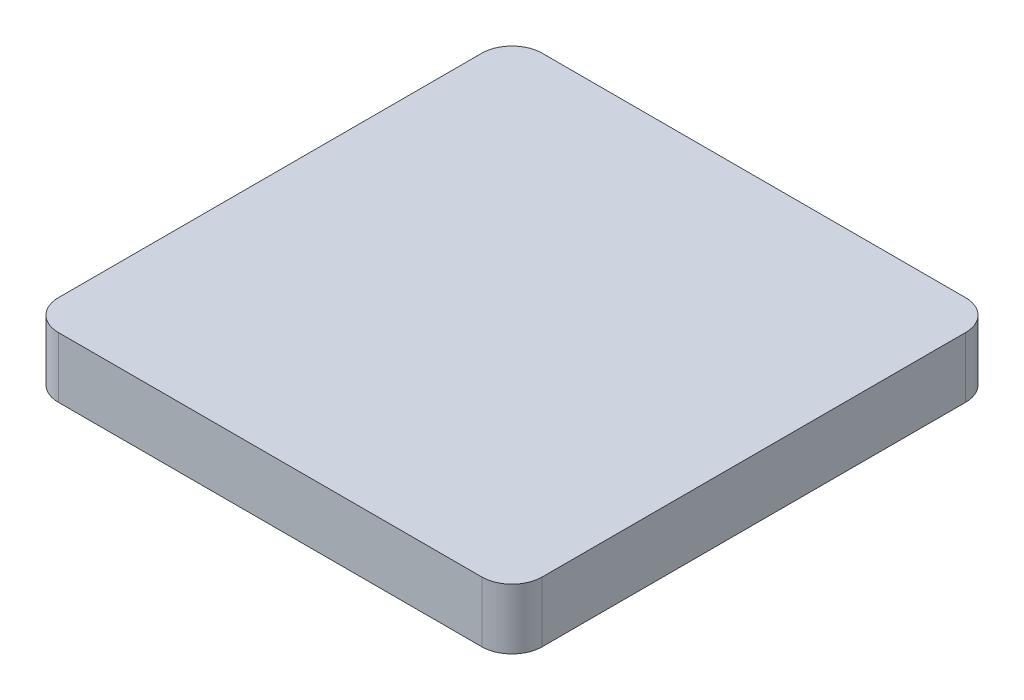
ISO-10303-21;
HEADER;
FILE_DESCRIPTION(('STEP AP214'),'2;1');
FILE_NAME('part.step','',(''),(''),'','','');
FILE_SCHEMA(('AUTOMOTIVE_DESIGN { 1 0 10303 214 1 1 1 1 }'));
ENDSEC;
DATA;
#1=APPLICATION_CONTEXT('core data for automotive mechanical design processes');
#2=APPLICATION_PROTOCOL_DEFINITION('international standard','automotive_design',2000,#1);
#3=PRODUCT_CONTEXT('',#1,'mechanical');
#4=PRODUCT('Part','Part','',(#3));
#5=PRODUCT_RELATED_PRODUCT_CATEGORY('part','',(#4));
#6=PRODUCT_DEFINITION_FORMATION('','',#4);
#7=PRODUCT_DEFINITION_CONTEXT('part definition',#1,'design');
#8=PRODUCT_DEFINITION('design','',#6,#7);
#9=PRODUCT_DEFINITION_SHAPE('','',#8);
#10=(LENGTH_UNIT() NAMED_UNIT(*) SI_UNIT(.MILLI.,.METRE.));
#11=(NAMED_UNIT(*) PLANE_ANGLE_UNIT() SI_UNIT($,.RADIAN.));
#12=(NAMED_UNIT(*) SI_UNIT($,.STERADIAN.) SOLID_ANGLE_UNIT());
#13=UNCERTAINTY_MEASURE_WITH_UNIT(LENGTH_MEASURE(1.E-05),#10,'distance_accuracy_value','');
#14=(GEOMETRIC_REPRESENTATION_CONTEXT(3) GLOBAL_UNCERTAINTY_ASSIGNED_CONTEXT((#13)) GLOBAL_UNIT_ASSIGNED_CONTEXT((#10,
#11,#12)) REPRESENTATION_CONTEXT('',''));
#15=CARTESIAN_POINT('',(0.,0.,0.));
#16=DIRECTION('',(0.,0.,1.));
#17=DIRECTION('',(1.,0.,0.));
#18=AXIS2_PLACEMENT_3D('',#15,#16,#17);
#19=CARTESIAN_POINT('',(0.,10.,0.));
#20=DIRECTION('',(1.,0.,0.));
#21=DIRECTION('',(0.,0.,-1.));
#22=AXIS2_PLACEMENT_3D('',#19,#20,#21);
#23=PLANE('',#22);
#24=DIRECTION('',(0.,0.,1.));
#25=VECTOR('',#24,1.);
#26=CARTESIAN_POINT('',(0.,10.,0.));
#27=LINE('',#26,#25);
#28=CARTESIAN_POINT('',(0.,10.,-75.));
#29=VERTEX_POINT('',#28);
#30=CARTESIAN_POINT('',(0.,10.,-5.));
#31=VERTEX_POINT('',#30);
#32=EDGE_CURVE('E203',#29,#31,#27,.T.);
#33=ORIENTED_EDGE('',*,*,#32,.F.);
#34=DIRECTION('',(0.,-1.,0.));
#35=VECTOR('',#34,1.);
#36=CARTESIAN_POINT('',(0.,10.,-75.));
#37=LINE('',#36,#35);
#38=CARTESIAN_POINT('',(0.,0.,-75.));
#39=VERTEX_POINT('',#38);
#40=EDGE_CURVE('E269',#29,#39,#37,.T.);
#41=ORIENTED_EDGE('',*,*,#40,.T.);
#42=DIRECTION('',(0.,0.,1.));
#43=VECTOR('',#42,1.);
#44=CARTESIAN_POINT('',(0.,0.,0.));
#45=LINE('',#44,#43);
#46=CARTESIAN_POINT('',(0.,0.,-5.));
#47=VERTEX_POINT('',#46);
#48=EDGE_CURVE('E199',#39,#47,#45,.T.);
#49=ORIENTED_EDGE('',*,*,#48,.T.);
#50=DIRECTION('',(0.,-1.,0.));
#51=VECTOR('',#50,1.);
#52=CARTESIAN_POINT('',(0.,10.,-5.));
#53=LINE('',#52,#51);
#54=EDGE_CURVE('E267',#47,#31,#53,.F.);
#55=ORIENTED_EDGE('',*,*,#54,.T.);
#56=EDGE_LOOP('',(#33,#41,#49,#55));
#57=FACE_BOUND('',#56,.T.);
#58=ADVANCED_FACE('F31',(#57),#23,.F.);
#59=CARTESIAN_POINT('',(0.,10.,0.));
#60=DIRECTION('',(0.,0.,-1.));
#61=DIRECTION('',(-1.,0.,0.));
#62=AXIS2_PLACEMENT_3D('',#59,#60,#61);
#63=PLANE('',#62);
#64=DIRECTION('',(1.,0.,0.));
#65=VECTOR('',#64,1.);
#66=CARTESIAN_POINT('',(0.,10.,0.));
#67=LINE('',#66,#65);
#68=CARTESIAN_POINT('',(5.,10.,0.));
#69=VERTEX_POINT('',#68);
#70=CARTESIAN_POINT('',(75.,10.,0.));
#71=VERTEX_POINT('',#70);
#72=EDGE_CURVE('E206',#69,#71,#67,.T.);
#73=ORIENTED_EDGE('',*,*,#72,.F.);
#74=DIRECTION('',(0.,-1.,0.));
#75=VECTOR('',#74,1.);
#76=CARTESIAN_POINT('',(5.,10.,0.));
#77=LINE('',#76,#75);
#78=CARTESIAN_POINT('',(5.,0.,0.));
#79=VERTEX_POINT('',#78);
#80=EDGE_CURVE('E11',#69,#79,#77,.T.);
#81=ORIENTED_EDGE('',*,*,#80,.T.);
#82=DIRECTION('',(1.,0.,0.));
#83=VECTOR('',#82,1.);
#84=CARTESIAN_POINT('',(0.,0.,0.));
#85=LINE('',#84,#83);
#86=CARTESIAN_POINT('',(75.,0.,0.));
#87=VERTEX_POINT('',#86);
#88=EDGE_CURVE('E218',#79,#87,#85,.T.);
#89=ORIENTED_EDGE('',*,*,#88,.T.);
#90=DIRECTION('',(0.,-1.,0.));
#91=VECTOR('',#90,1.);
#92=CARTESIAN_POINT('',(75.,10.,0.));
#93=LINE('',#92,#91);
#94=EDGE_CURVE('E39',#87,#71,#93,.F.);
#95=ORIENTED_EDGE('',*,*,#94,.T.);
#96=EDGE_LOOP('',(#73,#81,#89,#95));
#97=FACE_BOUND('',#96,.T.);
#98=ADVANCED_FACE('F286',(#97),#63,.F.);
#99=CARTESIAN_POINT('',(80.,10.,0.));
#100=DIRECTION('',(-1.,0.,0.));
#101=DIRECTION('',(0.,0.,1.));
#102=AXIS2_PLACEMENT_3D('',#99,#100,#101);
#103=PLANE('',#102);
#104=DIRECTION('',(0.,0.,-1.));
#105=VECTOR('',#104,1.);
#106=CARTESIAN_POINT('',(80.,0.,0.));
#107=LINE('',#106,#105);
#108=CARTESIAN_POINT('',(80.,0.,-5.));
#109=VERTEX_POINT('',#108);
#110=CARTESIAN_POINT('',(80.,0.,-75.));
#111=VERTEX_POINT('',#110);
#112=EDGE_CURVE('E220',#109,#111,#107,.T.);
#113=ORIENTED_EDGE('',*,*,#112,.T.);
#114=DIRECTION('',(0.,-1.,0.));
#115=VECTOR('',#114,1.);
#116=CARTESIAN_POINT('',(80.,10.,-75.));
#117=LINE('',#116,#115);
#118=CARTESIAN_POINT('',(80.,10.,-75.));
#119=VERTEX_POINT('',#118);
#120=EDGE_CURVE('E257',#111,#119,#117,.F.);
#121=ORIENTED_EDGE('',*,*,#120,.T.);
#122=DIRECTION('',(0.,0.,-1.));
#123=VECTOR('',#122,1.);
#124=CARTESIAN_POINT('',(80.,10.,0.));
#125=LINE('',#124,#123);
#126=CARTESIAN_POINT('',(80.,10.,-5.));
#127=VERTEX_POINT('',#126);
#128=EDGE_CURVE('E209',#127,#119,#125,.T.);
#129=ORIENTED_EDGE('',*,*,#128,.F.);
#130=DIRECTION('',(0.,-1.,0.));
#131=VECTOR('',#130,1.);
#132=CARTESIAN_POINT('',(80.,10.,-5.));
#133=LINE('',#132,#131);
#134=EDGE_CURVE('E254',#127,#109,#133,.T.);
#135=ORIENTED_EDGE('',*,*,#134,.T.);
#136=EDGE_LOOP('',(#113,#121,#129,#135));
#137=FACE_BOUND('',#136,.T.);
#138=ADVANCED_FACE('F295',(#137),#103,.F.);
#139=CARTESIAN_POINT('',(0.,10.,-80.));
#140=DIRECTION('',(0.,0.,1.));
#141=DIRECTION('',(1.,0.,0.));
#142=AXIS2_PLACEMENT_3D('',#139,#140,#141);
#143=PLANE('',#142);
#144=DIRECTION('',(-1.,0.,0.));
#145=VECTOR('',#144,1.);
#146=CARTESIAN_POINT('',(0.,10.,-80.));
#147=LINE('',#146,#145);
#148=CARTESIAN_POINT('',(75.,10.,-80.));
#149=VERTEX_POINT('',#148);
#150=CARTESIAN_POINT('',(4.99999999999999,10.,-80.));
#151=VERTEX_POINT('',#150);
#152=EDGE_CURVE('E212',#149,#151,#147,.T.);
#153=ORIENTED_EDGE('',*,*,#152,.F.);
#154=DIRECTION('',(0.,-1.,0.));
#155=VECTOR('',#154,1.);
#156=CARTESIAN_POINT('',(75.,10.,-80.));
#157=LINE('',#156,#155);
#158=CARTESIAN_POINT('',(75.,0.,-80.));
#159=VERTEX_POINT('',#158);
#160=EDGE_CURVE('E243',#149,#159,#157,.T.);
#161=ORIENTED_EDGE('',*,*,#160,.T.);
#162=DIRECTION('',(-1.,0.,0.));
#163=VECTOR('',#162,1.);
#164=CARTESIAN_POINT('',(0.,0.,-80.));
#165=LINE('',#164,#163);
#166=CARTESIAN_POINT('',(4.99999999999999,0.,-80.));
#167=VERTEX_POINT('',#166);
#168=EDGE_CURVE('E207',#159,#167,#165,.T.);
#169=ORIENTED_EDGE('',*,*,#168,.T.);
#170=DIRECTION('',(0.,-1.,0.));
#171=VECTOR('',#170,1.);
#172=CARTESIAN_POINT('',(4.99999999999999,10.,-80.));
#173=LINE('',#172,#171);
#174=EDGE_CURVE('E241',#167,#151,#173,.F.);
#175=ORIENTED_EDGE('',*,*,#174,.T.);
#176=EDGE_LOOP('',(#153,#161,#169,#175));
#177=FACE_BOUND('',#176,.T.);
#178=ADVANCED_FACE('F303',(#177),#143,.F.);
#179=CARTESIAN_POINT('',(0.,10.,-80.));
#180=DIRECTION('',(0.,-1.,0.));
#181=DIRECTION('',(0.,0.,-1.));
#182=AXIS2_PLACEMENT_3D('',#179,#180,#181);
#183=PLANE('',#182);
#184=ORIENTED_EDGE('',*,*,#128,.T.);
#185=CARTESIAN_POINT('',(75.,10.,-75.));
#186=DIRECTION('',(0.,-1.,0.));
#187=DIRECTION('',(0.,0.,-1.));
#188=AXIS2_PLACEMENT_3D('',#185,#186,#187);
#189=CIRCLE('',#188,5.);
#190=EDGE_CURVE('E265',#119,#149,#189,.F.);
#191=ORIENTED_EDGE('',*,*,#190,.T.);
#192=ORIENTED_EDGE('',*,*,#152,.T.);
#193=CARTESIAN_POINT('',(4.99999999999999,10.,-75.));
#194=DIRECTION('',(0.,-1.,0.));
#195=DIRECTION('',(0.,0.,-1.));
#196=AXIS2_PLACEMENT_3D('',#193,#194,#195);
#197=CIRCLE('',#196,5.);
#198=EDGE_CURVE('E263',#151,#29,#197,.F.);
#199=ORIENTED_EDGE('',*,*,#198,.T.);
#200=ORIENTED_EDGE('',*,*,#32,.T.);
#201=CARTESIAN_POINT('',(5.,10.,-5.));
#202=DIRECTION('',(0.,-1.,0.));
#203=DIRECTION('',(0.,0.,-1.));
#204=AXIS2_PLACEMENT_3D('',#201,#202,#203);
#205=CIRCLE('',#204,5.);
#206=EDGE_CURVE('E261',#31,#69,#205,.F.);
#207=ORIENTED_EDGE('',*,*,#206,.T.);
#208=ORIENTED_EDGE('',*,*,#72,.T.);
#209=CARTESIAN_POINT('',(75.,10.,-5.));
#210=DIRECTION('',(0.,-1.,0.));
#211=DIRECTION('',(0.,0.,-1.));
#212=AXIS2_PLACEMENT_3D('',#209,#210,#211);
#213=CIRCLE('',#212,5.);
#214=EDGE_CURVE('E259',#71,#127,#213,.F.);
#215=ORIENTED_EDGE('',*,*,#214,.T.);
#216=EDGE_LOOP('',(#184,#191,#192,#199,#200,#207,#208,#215));
#217=FACE_BOUND('',#216,.T.);
#218=ADVANCED_FACE('F289',(#217),#183,.F.);
#219=CARTESIAN_POINT('',(0.,0.,-80.));
#220=DIRECTION('',(0.,-1.,0.));
#221=DIRECTION('',(0.,0.,-1.));
#222=AXIS2_PLACEMENT_3D('',#219,#220,#221);
#223=PLANE('',#222);
#224=DIRECTION('',(-1.,0.,0.));
#225=VECTOR('',#224,1.);
#226=CARTESIAN_POINT('',(44.,0.,-37.5));
#227=LINE('',#226,#225);
#228=CARTESIAN_POINT('',(49.,0.,-37.5));
#229=VERTEX_POINT('',#228);
#230=CARTESIAN_POINT('',(44.,0.,-37.5));
#231=VERTEX_POINT('',#230);
#232=EDGE_CURVE('E46',#229,#231,#227,.T.);
#233=ORIENTED_EDGE('',*,*,#232,.F.);
#234=DIRECTION('',(0.,0.,1.));
#235=VECTOR('',#234,1.);
#236=CARTESIAN_POINT('',(49.,0.,-37.5));
#237=LINE('',#236,#235);
#238=CARTESIAN_POINT('',(49.,0.,-42.5));
#239=VERTEX_POINT('',#238);
#240=EDGE_CURVE('E170',#239,#229,#237,.T.);
#241=ORIENTED_EDGE('',*,*,#240,.F.);
#242=DIRECTION('',(1.,0.,0.));
#243=VECTOR('',#242,1.);
#244=CARTESIAN_POINT('',(44.,0.,-42.5));
#245=LINE('',#244,#243);
#246=CARTESIAN_POINT('',(44.,0.,-42.5));
#247=VERTEX_POINT('',#246);
#248=EDGE_CURVE('E176',#247,#239,#245,.T.);
#249=ORIENTED_EDGE('',*,*,#248,.F.);
#250=DIRECTION('',(0.,0.,-1.));
#251=VECTOR('',#250,1.);
#252=CARTESIAN_POINT('',(44.,0.,-45.5));
#253=LINE('',#252,#251);
#254=CARTESIAN_POINT('',(44.,0.,-45.5));
#255=VERTEX_POINT('',#254);
#256=EDGE_CURVE('E232',#247,#255,#253,.T.);
#257=ORIENTED_EDGE('',*,*,#256,.T.);
#258=DIRECTION('',(1.,0.,0.));
#259=VECTOR('',#258,1.);
#260=CARTESIAN_POINT('',(11.5,0.,-45.5));
#261=LINE('',#260,#259);
#262=CARTESIAN_POINT('',(3.49999999999997,0.,-45.5));
#263=VERTEX_POINT('',#262);
#264=EDGE_CURVE('E182',#263,#255,#261,.T.);
#265=ORIENTED_EDGE('',*,*,#264,.F.);
#266=DIRECTION('',(0.,0.,1.));
#267=VECTOR('',#266,1.);
#268=CARTESIAN_POINT('',(3.49999999999996,0.,-34.5));
#269=LINE('',#268,#267);
#270=CARTESIAN_POINT('',(3.49999999999996,0.,-34.5));
#271=VERTEX_POINT('',#270);
#272=EDGE_CURVE('E215',#263,#271,#269,.T.);
#273=ORIENTED_EDGE('',*,*,#272,.T.);
#274=DIRECTION('',(-1.,0.,0.));
#275=VECTOR('',#274,1.);
#276=CARTESIAN_POINT('',(11.5,0.,-34.5));
#277=LINE('',#276,#275);
#278=CARTESIAN_POINT('',(44.,0.,-34.5));
#279=VERTEX_POINT('',#278);
#280=EDGE_CURVE('E190',#279,#271,#277,.T.);
#281=ORIENTED_EDGE('',*,*,#280,.F.);
#282=EDGE_CURVE('E233',#279,#231,#253,.T.);
#283=ORIENTED_EDGE('',*,*,#282,.T.);
#284=EDGE_LOOP('',(#233,#241,#249,#257,#265,#273,#281,#283));
#285=FACE_BOUND('',#284,.T.);
#286=ORIENTED_EDGE('',*,*,#168,.F.);
#287=CARTESIAN_POINT('',(75.,0.,-75.));
#288=DIRECTION('',(0.,-1.,0.));
#289=DIRECTION('',(0.,0.,-1.));
#290=AXIS2_PLACEMENT_3D('',#287,#288,#289);
#291=CIRCLE('',#290,5.);
#292=EDGE_CURVE('E252',#159,#111,#291,.T.);
#293=ORIENTED_EDGE('',*,*,#292,.T.);
#294=ORIENTED_EDGE('',*,*,#112,.F.);
#295=CARTESIAN_POINT('',(75.,0.,-5.));
#296=DIRECTION('',(0.,-1.,0.));
#297=DIRECTION('',(0.,0.,-1.));
#298=AXIS2_PLACEMENT_3D('',#295,#296,#297);
#299=CIRCLE('',#298,5.);
#300=EDGE_CURVE('E246',#109,#87,#299,.T.);
#301=ORIENTED_EDGE('',*,*,#300,.T.);
#302=ORIENTED_EDGE('',*,*,#88,.F.);
#303=CARTESIAN_POINT('',(5.,0.,-5.));
#304=DIRECTION('',(0.,-1.,0.));
#305=DIRECTION('',(0.,0.,-1.));
#306=AXIS2_PLACEMENT_3D('',#303,#304,#305);
#307=CIRCLE('',#306,5.);
#308=EDGE_CURVE('E248',#79,#47,#307,.T.);
#309=ORIENTED_EDGE('',*,*,#308,.T.);
#310=ORIENTED_EDGE('',*,*,#48,.F.);
#311=CARTESIAN_POINT('',(4.99999999999999,0.,-75.));
#312=DIRECTION('',(0.,-1.,0.));
#313=DIRECTION('',(0.,0.,-1.));
#314=AXIS2_PLACEMENT_3D('',#311,#312,#313);
#315=CIRCLE('',#314,5.);
#316=EDGE_CURVE('E250',#39,#167,#315,.T.);
#317=ORIENTED_EDGE('',*,*,#316,.T.);
#318=EDGE_LOOP('',(#286,#293,#294,#301,#302,#309,#310,#317));
#319=FACE_BOUND('',#318,.T.);
#320=ADVANCED_FACE('F280',(#285,#319),#223,.T.);
#321=CARTESIAN_POINT('',(11.5,8.,-34.5));
#322=DIRECTION('',(0.,0.,1.));
#323=DIRECTION('',(1.,0.,0.));
#324=AXIS2_PLACEMENT_3D('',#321,#322,#323);
#325=PLANE('',#324);
#326=ORIENTED_EDGE('',*,*,#280,.T.);
#327=DIRECTION('',(0.707106781186549,0.707106781186546,0.));
#328=VECTOR('',#327,1.);
#329=CARTESIAN_POINT('',(11.5,8.,-34.5));
#330=LINE('',#329,#328);
#331=CARTESIAN_POINT('',(11.5,8.,-34.5));
#332=VERTEX_POINT('',#331);
#333=EDGE_CURVE('E230',#271,#332,#330,.T.);
#334=ORIENTED_EDGE('',*,*,#333,.T.);
#335=DIRECTION('',(-1.,0.,0.));
#336=VECTOR('',#335,1.);
#337=CARTESIAN_POINT('',(11.5,8.,-34.5));
#338=LINE('',#337,#336);
#339=CARTESIAN_POINT('',(36.,8.,-34.5));
#340=VERTEX_POINT('',#339);
#341=EDGE_CURVE('E196',#340,#332,#338,.T.);
#342=ORIENTED_EDGE('',*,*,#341,.F.);
#343=DIRECTION('',(0.707106781186549,-0.707106781186546,0.));
#344=VECTOR('',#343,1.);
#345=CARTESIAN_POINT('',(23.75,20.25,-34.5));
#346=LINE('',#345,#344);
#347=EDGE_CURVE('E236',#340,#279,#346,.T.);
#348=ORIENTED_EDGE('',*,*,#347,.T.);
#349=EDGE_LOOP('',(#326,#334,#342,#348));
#350=FACE_BOUND('',#349,.T.);
#351=ADVANCED_FACE('F349',(#350),#325,.F.);
#352=CARTESIAN_POINT('',(11.5,8.,-45.5));
#353=DIRECTION('',(0.,0.,-1.));
#354=DIRECTION('',(-1.,0.,0.));
#355=AXIS2_PLACEMENT_3D('',#352,#353,#354);
#356=PLANE('',#355);
#357=ORIENTED_EDGE('',*,*,#264,.T.);
#358=DIRECTION('',(-0.707106781186549,0.707106781186546,0.));
#359=VECTOR('',#358,1.);
#360=CARTESIAN_POINT('',(23.75,20.25,-45.5));
#361=LINE('',#360,#359);
#362=CARTESIAN_POINT('',(36.,8.,-45.5));
#363=VERTEX_POINT('',#362);
#364=EDGE_CURVE('E239',#255,#363,#361,.T.);
#365=ORIENTED_EDGE('',*,*,#364,.T.);
#366=DIRECTION('',(1.,0.,0.));
#367=VECTOR('',#366,1.);
#368=CARTESIAN_POINT('',(11.5,8.,-45.5));
#369=LINE('',#368,#367);
#370=CARTESIAN_POINT('',(11.5,8.,-45.5));
#371=VERTEX_POINT('',#370);
#372=EDGE_CURVE('E189',#371,#363,#369,.T.);
#373=ORIENTED_EDGE('',*,*,#372,.F.);
#374=DIRECTION('',(-0.707106781186549,-0.707106781186546,0.));
#375=VECTOR('',#374,1.);
#376=CARTESIAN_POINT('',(11.5,8.,-45.5));
#377=LINE('',#376,#375);
#378=EDGE_CURVE('E227',#371,#263,#377,.T.);
#379=ORIENTED_EDGE('',*,*,#378,.T.);
#380=EDGE_LOOP('',(#357,#365,#373,#379));
#381=FACE_BOUND('',#380,.T.);
#382=ADVANCED_FACE('F336',(#381),#356,.F.);
#383=CARTESIAN_POINT('',(11.5,8.,-45.5));
#384=DIRECTION('',(0.,-1.,0.));
#385=DIRECTION('',(0.,0.,-1.));
#386=AXIS2_PLACEMENT_3D('',#383,#384,#385);
#387=PLANE('',#386);
#388=DIRECTION('',(0.,0.,-1.));
#389=VECTOR('',#388,1.);
#390=CARTESIAN_POINT('',(11.5,8.,-34.5));
#391=LINE('',#390,#389);
#392=EDGE_CURVE('E186',#332,#371,#391,.T.);
#393=ORIENTED_EDGE('',*,*,#392,.T.);
#394=ORIENTED_EDGE('',*,*,#372,.T.);
#395=DIRECTION('',(0.,0.,1.));
#396=VECTOR('',#395,1.);
#397=CARTESIAN_POINT('',(36.,8.,-34.5));
#398=LINE('',#397,#396);
#399=EDGE_CURVE('E193',#363,#340,#398,.T.);
#400=ORIENTED_EDGE('',*,*,#399,.T.);
#401=ORIENTED_EDGE('',*,*,#341,.T.);
#402=EDGE_LOOP('',(#393,#394,#400,#401));
#403=FACE_BOUND('',#402,.T.);
#404=ADVANCED_FACE('F325',(#403),#387,.T.);
#405=CARTESIAN_POINT('',(11.5,7.99999999999999,-34.5));
#406=DIRECTION('',(0.707106781186546,-0.707106781186549,0.));
#407=DIRECTION('',(0.707106781186549,0.707106781186546,0.));
#408=AXIS2_PLACEMENT_3D('',#405,#406,#407);
#409=PLANE('',#408);
#410=ORIENTED_EDGE('',*,*,#333,.F.);
#411=ORIENTED_EDGE('',*,*,#272,.F.);
#412=ORIENTED_EDGE('',*,*,#378,.F.);
#413=ORIENTED_EDGE('',*,*,#392,.F.);
#414=EDGE_LOOP('',(#410,#411,#412,#413));
#415=FACE_BOUND('',#414,.T.);
#416=ADVANCED_FACE('F322',(#415),#409,.T.);
#417=CARTESIAN_POINT('',(36.,8.00000000000001,-34.5));
#418=DIRECTION('',(-0.707106781186546,-0.707106781186549,0.));
#419=DIRECTION('',(0.707106781186549,-0.707106781186546,0.));
#420=AXIS2_PLACEMENT_3D('',#417,#418,#419);
#421=PLANE('',#420);
#422=ORIENTED_EDGE('',*,*,#364,.F.);
#423=ORIENTED_EDGE('',*,*,#256,.F.);
#424=DIRECTION('',(0.,0.,-1.));
#425=VECTOR('',#424,1.);
#426=CARTESIAN_POINT('',(44.,0.,-37.5));
#427=LINE('',#426,#425);
#428=EDGE_CURVE('E152',#231,#247,#427,.T.);
#429=ORIENTED_EDGE('',*,*,#428,.F.);
#430=ORIENTED_EDGE('',*,*,#282,.F.);
#431=ORIENTED_EDGE('',*,*,#347,.F.);
#432=ORIENTED_EDGE('',*,*,#399,.F.);
#433=EDGE_LOOP('',(#422,#423,#429,#430,#431,#432));
#434=FACE_BOUND('',#433,.T.);
#435=ADVANCED_FACE('F312',(#434),#421,.T.);
#436=CARTESIAN_POINT('',(75.,10.,-75.));
#437=DIRECTION('',(0.,-1.,0.));
#438=DIRECTION('',(0.,0.,-1.));
#439=AXIS2_PLACEMENT_3D('',#436,#437,#438);
#440=CYLINDRICAL_SURFACE('',#439,5.);
#441=ORIENTED_EDGE('',*,*,#190,.F.);
#442=ORIENTED_EDGE('',*,*,#120,.F.);
#443=ORIENTED_EDGE('',*,*,#292,.F.);
#444=ORIENTED_EDGE('',*,*,#160,.F.);
#445=EDGE_LOOP('',(#441,#442,#443,#444));
#446=FACE_BOUND('',#445,.T.);
#447=ADVANCED_FACE('F300',(#446),#440,.T.);
#448=CARTESIAN_POINT('',(4.99999999999999,10.,-75.));
#449=DIRECTION('',(0.,-1.,0.));
#450=DIRECTION('',(0.,0.,-1.));
#451=AXIS2_PLACEMENT_3D('',#448,#449,#450);
#452=CYLINDRICAL_SURFACE('',#451,5.);
#453=ORIENTED_EDGE('',*,*,#198,.F.);
#454=ORIENTED_EDGE('',*,*,#174,.F.);
#455=ORIENTED_EDGE('',*,*,#316,.F.);
#456=ORIENTED_EDGE('',*,*,#40,.F.);
#457=EDGE_LOOP('',(#453,#454,#455,#456));
#458=FACE_BOUND('',#457,.T.);
#459=ADVANCED_FACE('F305',(#458),#452,.T.);
#460=CARTESIAN_POINT('',(5.,10.,-5.));
#461=DIRECTION('',(0.,-1.,0.));
#462=DIRECTION('',(0.,0.,-1.));
#463=AXIS2_PLACEMENT_3D('',#460,#461,#462);
#464=CYLINDRICAL_SURFACE('',#463,5.);
#465=ORIENTED_EDGE('',*,*,#206,.F.);
#466=ORIENTED_EDGE('',*,*,#54,.F.);
#467=ORIENTED_EDGE('',*,*,#308,.F.);
#468=ORIENTED_EDGE('',*,*,#80,.F.);
#469=EDGE_LOOP('',(#465,#466,#467,#468));
#470=FACE_BOUND('',#469,.T.);
#471=ADVANCED_FACE('F285',(#470),#464,.T.);
#472=CARTESIAN_POINT('',(75.,10.,-5.));
#473=DIRECTION('',(0.,-1.,0.));
#474=DIRECTION('',(0.,0.,-1.));
#475=AXIS2_PLACEMENT_3D('',#472,#473,#474);
#476=CYLINDRICAL_SURFACE('',#475,5.);
#477=ORIENTED_EDGE('',*,*,#214,.F.);
#478=ORIENTED_EDGE('',*,*,#94,.F.);
#479=ORIENTED_EDGE('',*,*,#300,.F.);
#480=ORIENTED_EDGE('',*,*,#134,.F.);
#481=EDGE_LOOP('',(#477,#478,#479,#480));
#482=FACE_BOUND('',#481,.T.);
#483=ADVANCED_FACE('F33',(#482),#476,.T.);
#484=CARTESIAN_POINT('',(44.,5.,-37.5));
#485=DIRECTION('',(-1.,0.,0.));
#486=DIRECTION('',(0.,0.,1.));
#487=AXIS2_PLACEMENT_3D('',#484,#485,#486);
#488=PLANE('',#487);
#489=ORIENTED_EDGE('',*,*,#428,.T.);
#490=DIRECTION('',(0.,-1.,0.));
#491=VECTOR('',#490,1.);
#492=CARTESIAN_POINT('',(44.,5.,-42.5));
#493=LINE('',#492,#491);
#494=CARTESIAN_POINT('',(44.,5.,-42.5));
#495=VERTEX_POINT('',#494);
#496=EDGE_CURVE('E145',#495,#247,#493,.T.);
#497=ORIENTED_EDGE('',*,*,#496,.F.);
#498=DIRECTION('',(0.,0.,-1.));
#499=VECTOR('',#498,1.);
#500=CARTESIAN_POINT('',(44.,5.,-37.5));
#501=LINE('',#500,#499);
#502=CARTESIAN_POINT('',(44.,5.,-37.5));
#503=VERTEX_POINT('',#502);
#504=EDGE_CURVE('E149',#503,#495,#501,.T.);
#505=ORIENTED_EDGE('',*,*,#504,.F.);
#506=DIRECTION('',(0.,-1.,0.));
#507=VECTOR('',#506,1.);
#508=CARTESIAN_POINT('',(44.,5.,-37.5));
#509=LINE('',#508,#507);
#510=EDGE_CURVE('E180',#503,#231,#509,.T.);
#511=ORIENTED_EDGE('',*,*,#510,.T.);
#512=EDGE_LOOP('',(#489,#497,#505,#511));
#513=FACE_BOUND('',#512,.T.);
#514=ADVANCED_FACE('F147',(#513),#488,.F.);
#515=CARTESIAN_POINT('',(44.,5.,-37.5));
#516=DIRECTION('',(0.,0.,1.));
#517=DIRECTION('',(1.,0.,0.));
#518=AXIS2_PLACEMENT_3D('',#515,#516,#517);
#519=PLANE('',#518);
#520=ORIENTED_EDGE('',*,*,#232,.T.);
#521=ORIENTED_EDGE('',*,*,#510,.F.);
#522=DIRECTION('',(-1.,0.,0.));
#523=VECTOR('',#522,1.);
#524=CARTESIAN_POINT('',(44.,5.,-37.5));
#525=LINE('',#524,#523);
#526=CARTESIAN_POINT('',(49.,5.,-37.5));
#527=VERTEX_POINT('',#526);
#528=EDGE_CURVE('E157',#527,#503,#525,.T.);
#529=ORIENTED_EDGE('',*,*,#528,.F.);
#530=DIRECTION('',(0.,-1.,0.));
#531=VECTOR('',#530,1.);
#532=CARTESIAN_POINT('',(49.,5.,-37.5));
#533=LINE('',#532,#531);
#534=EDGE_CURVE('E183',#527,#229,#533,.T.);
#535=ORIENTED_EDGE('',*,*,#534,.T.);
#536=EDGE_LOOP('',(#520,#521,#529,#535));
#537=FACE_BOUND('',#536,.T.);
#538=ADVANCED_FACE('F346',(#537),#519,.F.);
#539=CARTESIAN_POINT('',(49.,5.,-37.5));
#540=DIRECTION('',(1.,0.,0.));
#541=DIRECTION('',(0.,0.,-1.));
#542=AXIS2_PLACEMENT_3D('',#539,#540,#541);
#543=PLANE('',#542);
#544=ORIENTED_EDGE('',*,*,#240,.T.);
#545=ORIENTED_EDGE('',*,*,#534,.F.);
#546=DIRECTION('',(0.,0.,1.));
#547=VECTOR('',#546,1.);
#548=CARTESIAN_POINT('',(49.,5.,-37.5));
#549=LINE('',#548,#547);
#550=CARTESIAN_POINT('',(49.,5.,-42.5));
#551=VERTEX_POINT('',#550);
#552=EDGE_CURVE('E165',#551,#527,#549,.T.);
#553=ORIENTED_EDGE('',*,*,#552,.F.);
#554=DIRECTION('',(0.,-1.,0.));
#555=VECTOR('',#554,1.);
#556=CARTESIAN_POINT('',(49.,5.,-42.5));
#557=LINE('',#556,#555);
#558=EDGE_CURVE('E156',#551,#239,#557,.T.);
#559=ORIENTED_EDGE('',*,*,#558,.T.);
#560=EDGE_LOOP('',(#544,#545,#553,#559));
#561=FACE_BOUND('',#560,.T.);
#562=ADVANCED_FACE('F345',(#561),#543,.F.);
#563=CARTESIAN_POINT('',(44.,5.,-42.5));
#564=DIRECTION('',(0.,0.,-1.));
#565=DIRECTION('',(-1.,0.,0.));
#566=AXIS2_PLACEMENT_3D('',#563,#564,#565);
#567=PLANE('',#566);
#568=ORIENTED_EDGE('',*,*,#248,.T.);
#569=ORIENTED_EDGE('',*,*,#558,.F.);
#570=DIRECTION('',(1.,0.,0.));
#571=VECTOR('',#570,1.);
#572=CARTESIAN_POINT('',(44.,5.,-42.5));
#573=LINE('',#572,#571);
#574=EDGE_CURVE('E160',#495,#551,#573,.T.);
#575=ORIENTED_EDGE('',*,*,#574,.F.);
#576=ORIENTED_EDGE('',*,*,#496,.T.);
#577=EDGE_LOOP('',(#568,#569,#575,#576));
#578=FACE_BOUND('',#577,.T.);
#579=ADVANCED_FACE('F161',(#578),#567,.F.);
#580=CARTESIAN_POINT('',(44.,5.,-42.5));
#581=DIRECTION('',(0.,-1.,0.));
#582=DIRECTION('',(0.,0.,-1.));
#583=AXIS2_PLACEMENT_3D('',#580,#581,#582);
#584=PLANE('',#583);
#585=ORIENTED_EDGE('',*,*,#504,.T.);
#586=ORIENTED_EDGE('',*,*,#574,.T.);
#587=ORIENTED_EDGE('',*,*,#552,.T.);
#588=ORIENTED_EDGE('',*,*,#528,.T.);
#589=EDGE_LOOP('',(#585,#586,#587,#588));
#590=FACE_BOUND('',#589,.T.);
#591=ADVANCED_FACE('F167',(#590),#584,.T.);
#592=CLOSED_SHELL('',(#58,#98,#138,#178,#218,#320,#351,#382,#404,#416,#435,#447,#459,#471,#483,
#514,#538,#562,#579,#591));
#593=MANIFOLD_SOLID_BREP('B2',#592);
#594=ADVANCED_BREP_SHAPE_REPRESENTATION('',(#18,#593),#14);
#595=SHAPE_DEFINITION_REPRESENTATION(#9,#594);
ENDSEC;
END-ISO-10303-21;
